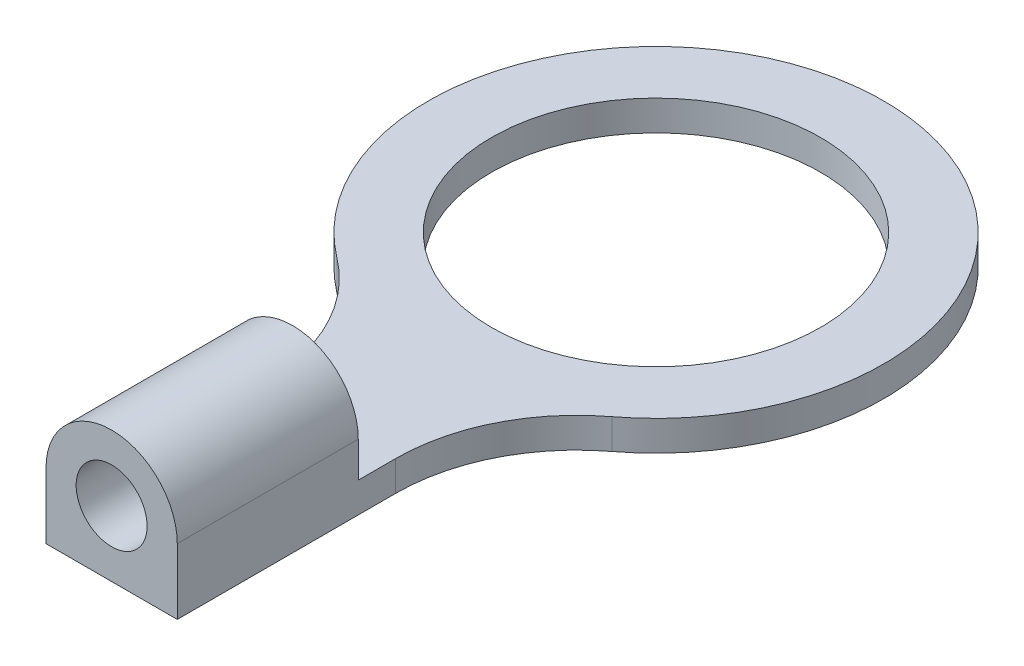
ISO-10303-21;
HEADER;
FILE_DESCRIPTION(('STEP AP214'),'2;1');
FILE_NAME('part.step','',(''),(''),'','','');
FILE_SCHEMA(('AUTOMOTIVE_DESIGN { 1 0 10303 214 1 1 1 1 }'));
ENDSEC;
DATA;
#1=APPLICATION_CONTEXT('core data for automotive mechanical design processes');
#2=APPLICATION_PROTOCOL_DEFINITION('international standard','automotive_design',2000,#1);
#3=PRODUCT_CONTEXT('',#1,'mechanical');
#4=PRODUCT('Part','Part','',(#3));
#5=PRODUCT_RELATED_PRODUCT_CATEGORY('part','',(#4));
#6=PRODUCT_DEFINITION_FORMATION('','',#4);
#7=PRODUCT_DEFINITION_CONTEXT('part definition',#1,'design');
#8=PRODUCT_DEFINITION('design','',#6,#7);
#9=PRODUCT_DEFINITION_SHAPE('','',#8);
#10=(LENGTH_UNIT() NAMED_UNIT(*) SI_UNIT(.MILLI.,.METRE.));
#11=(NAMED_UNIT(*) PLANE_ANGLE_UNIT() SI_UNIT($,.RADIAN.));
#12=(NAMED_UNIT(*) SI_UNIT($,.STERADIAN.) SOLID_ANGLE_UNIT());
#13=UNCERTAINTY_MEASURE_WITH_UNIT(LENGTH_MEASURE(1.E-05),#10,'distance_accuracy_value','');
#14=(GEOMETRIC_REPRESENTATION_CONTEXT(3) GLOBAL_UNCERTAINTY_ASSIGNED_CONTEXT((#13)) GLOBAL_UNIT_ASSIGNED_CONTEXT((#10,
#11,#12)) REPRESENTATION_CONTEXT('',''));
#15=CARTESIAN_POINT('',(0.,0.,0.));
#16=DIRECTION('',(0.,0.,1.));
#17=DIRECTION('',(1.,0.,0.));
#18=AXIS2_PLACEMENT_3D('',#15,#16,#17);
#19=CARTESIAN_POINT('',(6.4897,0.79375,8.5787348437867));
#20=DIRECTION('',(0.,-1.,0.));
#21=DIRECTION('',(0.,0.,-1.));
#22=AXIS2_PLACEMENT_3D('',#19,#20,#21);
#23=PLANE('',#22);
#24=CARTESIAN_POINT('',(0.,0.79375,0.));
#25=DIRECTION('',(0.,1.,0.));
#26=DIRECTION('',(0.,0.,1.));
#27=AXIS2_PLACEMENT_3D('',#24,#25,#26);
#28=CIRCLE('',#27,4.3307);
#29=CARTESIAN_POINT('',(0.,0.79375,4.3307));
#30=VERTEX_POINT('',#29);
#31=EDGE_CURVE('E133',#30,#30,#28,.T.);
#32=ORIENTED_EDGE('',*,*,#31,.F.);
#33=EDGE_LOOP('',(#32));
#34=FACE_BOUND('',#33,.T.);
#35=DIRECTION('',(-1.,0.,0.));
#36=VECTOR('',#35,1.);
#37=CARTESIAN_POINT('',(6.4897,0.79375,9.5631));
#38=LINE('',#37,#36);
#39=CARTESIAN_POINT('',(1.7272,0.79375,9.5631));
#40=VERTEX_POINT('',#39);
#41=CARTESIAN_POINT('',(0.,0.793750000000001,9.5631));
#42=VERTEX_POINT('',#41);
#43=EDGE_CURVE('E51',#40,#42,#38,.T.);
#44=ORIENTED_EDGE('',*,*,#43,.F.);
#45=DIRECTION('',(0.,0.,-1.));
#46=VECTOR('',#45,1.);
#47=CARTESIAN_POINT('',(1.7272,0.79375,14.3256));
#48=LINE('',#47,#46);
#49=CARTESIAN_POINT('',(1.7272,0.79375,8.5787348437867));
#50=VERTEX_POINT('',#49);
#51=EDGE_CURVE('E140',#40,#50,#48,.T.);
#52=ORIENTED_EDGE('',*,*,#51,.T.);
#53=CARTESIAN_POINT('',(6.4897,0.79375,8.5787348437867));
#54=DIRECTION('',(0.,-1.,0.));
#55=DIRECTION('',(0.,0.,-1.));
#56=AXIS2_PLACEMENT_3D('',#53,#54,#55);
#57=CIRCLE('',#56,4.7625);
#58=CARTESIAN_POINT('',(3.61645619834711,0.79375,4.7805936791822));
#59=VERTEX_POINT('',#58);
#60=EDGE_CURVE('E142',#50,#59,#57,.T.);
#61=ORIENTED_EDGE('',*,*,#60,.T.);
#62=CARTESIAN_POINT('',(0.,0.79375,0.));
#63=DIRECTION('',(0.,1.,0.));
#64=DIRECTION('',(0.,0.,1.));
#65=AXIS2_PLACEMENT_3D('',#62,#63,#64);
#66=CIRCLE('',#65,5.9944);
#67=CARTESIAN_POINT('',(-3.61645619834711,0.79375,4.7805936791822));
#68=VERTEX_POINT('',#67);
#69=EDGE_CURVE('E145',#59,#68,#66,.T.);
#70=ORIENTED_EDGE('',*,*,#69,.T.);
#71=CARTESIAN_POINT('',(-6.4897,0.79375,8.5787348437867));
#72=DIRECTION('',(0.,-1.,0.));
#73=DIRECTION('',(0.,0.,1.));
#74=AXIS2_PLACEMENT_3D('',#71,#72,#73);
#75=CIRCLE('',#74,4.7625);
#76=CARTESIAN_POINT('',(-1.7272,0.79375,8.5787348437867));
#77=VERTEX_POINT('',#76);
#78=EDGE_CURVE('E147',#68,#77,#75,.T.);
#79=ORIENTED_EDGE('',*,*,#78,.T.);
#80=DIRECTION('',(0.,0.,1.));
#81=VECTOR('',#80,1.);
#82=CARTESIAN_POINT('',(-1.7272,0.79375,14.3256));
#83=LINE('',#82,#81);
#84=CARTESIAN_POINT('',(-1.7272,0.79375,9.5631));
#85=VERTEX_POINT('',#84);
#86=EDGE_CURVE('E149',#77,#85,#83,.T.);
#87=ORIENTED_EDGE('',*,*,#86,.T.);
#88=EDGE_CURVE('E47',#42,#85,#38,.T.);
#89=ORIENTED_EDGE('',*,*,#88,.F.);
#90=EDGE_LOOP('',(#44,#52,#61,#70,#79,#87,#89));
#91=FACE_BOUND('',#90,.T.);
#92=ADVANCED_FACE('F32',(#34,#91),#23,.F.);
#93=CARTESIAN_POINT('',(6.4897,0.,8.5787348437867));
#94=DIRECTION('',(0.,-1.,0.));
#95=DIRECTION('',(0.,0.,-1.));
#96=AXIS2_PLACEMENT_3D('',#93,#94,#95);
#97=PLANE('',#96);
#98=DIRECTION('',(1.,0.,0.));
#99=VECTOR('',#98,1.);
#100=CARTESIAN_POINT('',(-1.7272,0.,14.3256));
#101=LINE('',#100,#99);
#102=CARTESIAN_POINT('',(-1.7272,0.,14.3256));
#103=VERTEX_POINT('',#102);
#104=CARTESIAN_POINT('',(1.7272,0.,14.3256));
#105=VERTEX_POINT('',#104);
#106=EDGE_CURVE('E143',#103,#105,#101,.T.);
#107=ORIENTED_EDGE('',*,*,#106,.F.);
#108=DIRECTION('',(0.,0.,1.));
#109=VECTOR('',#108,1.);
#110=CARTESIAN_POINT('',(-1.7272,0.,14.3256));
#111=LINE('',#110,#109);
#112=CARTESIAN_POINT('',(-1.7272,0.,8.5787348437867));
#113=VERTEX_POINT('',#112);
#114=EDGE_CURVE('E159',#113,#103,#111,.T.);
#115=ORIENTED_EDGE('',*,*,#114,.F.);
#116=CARTESIAN_POINT('',(-6.4897,0.,8.5787348437867));
#117=DIRECTION('',(0.,-1.,0.));
#118=DIRECTION('',(0.,0.,1.));
#119=AXIS2_PLACEMENT_3D('',#116,#117,#118);
#120=CIRCLE('',#119,4.7625);
#121=CARTESIAN_POINT('',(-3.61645619834711,0.,4.7805936791822));
#122=VERTEX_POINT('',#121);
#123=EDGE_CURVE('E157',#122,#113,#120,.T.);
#124=ORIENTED_EDGE('',*,*,#123,.F.);
#125=CARTESIAN_POINT('',(0.,0.,0.));
#126=DIRECTION('',(0.,1.,0.));
#127=DIRECTION('',(0.,0.,1.));
#128=AXIS2_PLACEMENT_3D('',#125,#126,#127);
#129=CIRCLE('',#128,5.9944);
#130=CARTESIAN_POINT('',(3.61645619834711,0.,4.7805936791822));
#131=VERTEX_POINT('',#130);
#132=EDGE_CURVE('E155',#131,#122,#129,.T.);
#133=ORIENTED_EDGE('',*,*,#132,.F.);
#134=CARTESIAN_POINT('',(6.4897,0.,8.5787348437867));
#135=DIRECTION('',(0.,-1.,0.));
#136=DIRECTION('',(0.,0.,-1.));
#137=AXIS2_PLACEMENT_3D('',#134,#135,#136);
#138=CIRCLE('',#137,4.7625);
#139=CARTESIAN_POINT('',(1.7272,0.,8.5787348437867));
#140=VERTEX_POINT('',#139);
#141=EDGE_CURVE('E153',#140,#131,#138,.T.);
#142=ORIENTED_EDGE('',*,*,#141,.F.);
#143=DIRECTION('',(0.,0.,-1.));
#144=VECTOR('',#143,1.);
#145=CARTESIAN_POINT('',(1.7272,0.,14.3256));
#146=LINE('',#145,#144);
#147=EDGE_CURVE('E136',#105,#140,#146,.T.);
#148=ORIENTED_EDGE('',*,*,#147,.F.);
#149=EDGE_LOOP('',(#107,#115,#124,#133,#142,#148));
#150=FACE_BOUND('',#149,.T.);
#151=CARTESIAN_POINT('',(0.,0.,0.));
#152=DIRECTION('',(0.,1.,0.));
#153=DIRECTION('',(0.,0.,1.));
#154=AXIS2_PLACEMENT_3D('',#151,#152,#153);
#155=CIRCLE('',#154,4.3307);
#156=CARTESIAN_POINT('',(0.,0.,4.3307));
#157=VERTEX_POINT('',#156);
#158=EDGE_CURVE('E137',#157,#157,#155,.T.);
#159=ORIENTED_EDGE('',*,*,#158,.T.);
#160=EDGE_LOOP('',(#159));
#161=FACE_BOUND('',#160,.T.);
#162=ADVANCED_FACE('F183',(#150,#161),#97,.T.);
#163=CARTESIAN_POINT('',(1.7272,0.79375,14.3256));
#164=DIRECTION('',(-1.,0.,0.));
#165=DIRECTION('',(0.,0.,1.));
#166=AXIS2_PLACEMENT_3D('',#163,#164,#165);
#167=PLANE('',#166);
#168=ORIENTED_EDGE('',*,*,#147,.T.);
#169=DIRECTION('',(0.,-1.,0.));
#170=VECTOR('',#169,1.);
#171=CARTESIAN_POINT('',(1.7272,0.79375,8.5787348437867));
#172=LINE('',#171,#170);
#173=EDGE_CURVE('E11',#50,#140,#172,.T.);
#174=ORIENTED_EDGE('',*,*,#173,.F.);
#175=ORIENTED_EDGE('',*,*,#51,.F.);
#176=DIRECTION('',(0.,1.,0.));
#177=VECTOR('',#176,1.);
#178=CARTESIAN_POINT('',(1.7272,1.7272,9.5631));
#179=LINE('',#178,#177);
#180=CARTESIAN_POINT('',(1.7272,1.7272,9.5631));
#181=VERTEX_POINT('',#180);
#182=EDGE_CURVE('E110',#40,#181,#179,.T.);
#183=ORIENTED_EDGE('',*,*,#182,.T.);
#184=DIRECTION('',(0.,0.,1.));
#185=VECTOR('',#184,1.);
#186=CARTESIAN_POINT('',(1.7272,1.7272,9.5631));
#187=LINE('',#186,#185);
#188=CARTESIAN_POINT('',(1.7272,1.7272,14.3256));
#189=VERTEX_POINT('',#188);
#190=EDGE_CURVE('E109',#181,#189,#187,.T.);
#191=ORIENTED_EDGE('',*,*,#190,.T.);
#192=DIRECTION('',(0.,-1.,0.));
#193=VECTOR('',#192,1.);
#194=CARTESIAN_POINT('',(1.7272,0.79375,14.3256));
#195=LINE('',#194,#193);
#196=EDGE_CURVE('E151',#189,#105,#195,.T.);
#197=ORIENTED_EDGE('',*,*,#196,.T.);
#198=EDGE_LOOP('',(#168,#174,#175,#183,#191,#197));
#199=FACE_BOUND('',#198,.T.);
#200=ADVANCED_FACE('F34',(#199),#167,.F.);
#201=CARTESIAN_POINT('',(6.4897,0.79375,8.5787348437867));
#202=DIRECTION('',(0.,-1.,0.));
#203=DIRECTION('',(0.,0.,-1.));
#204=AXIS2_PLACEMENT_3D('',#201,#202,#203);
#205=CYLINDRICAL_SURFACE('',#204,4.7625);
#206=ORIENTED_EDGE('',*,*,#141,.T.);
#207=DIRECTION('',(0.,-1.,0.));
#208=VECTOR('',#207,1.);
#209=CARTESIAN_POINT('',(3.61645619834711,0.79375,4.7805936791822));
#210=LINE('',#209,#208);
#211=EDGE_CURVE('E40',#59,#131,#210,.T.);
#212=ORIENTED_EDGE('',*,*,#211,.F.);
#213=ORIENTED_EDGE('',*,*,#60,.F.);
#214=ORIENTED_EDGE('',*,*,#173,.T.);
#215=EDGE_LOOP('',(#206,#212,#213,#214));
#216=FACE_BOUND('',#215,.T.);
#217=ADVANCED_FACE('F192',(#216),#205,.F.);
#218=CARTESIAN_POINT('',(0.,0.79375,0.));
#219=DIRECTION('',(0.,-1.,0.));
#220=DIRECTION('',(0.,0.,-1.));
#221=AXIS2_PLACEMENT_3D('',#218,#219,#220);
#222=CYLINDRICAL_SURFACE('',#221,5.9944);
#223=ORIENTED_EDGE('',*,*,#132,.T.);
#224=DIRECTION('',(0.,-1.,0.));
#225=VECTOR('',#224,1.);
#226=CARTESIAN_POINT('',(-3.61645619834711,0.79375,4.7805936791822));
#227=LINE('',#226,#225);
#228=EDGE_CURVE('E168',#68,#122,#227,.T.);
#229=ORIENTED_EDGE('',*,*,#228,.F.);
#230=ORIENTED_EDGE('',*,*,#69,.F.);
#231=ORIENTED_EDGE('',*,*,#211,.T.);
#232=EDGE_LOOP('',(#223,#229,#230,#231));
#233=FACE_BOUND('',#232,.T.);
#234=ADVANCED_FACE('F175',(#233),#222,.T.);
#235=CARTESIAN_POINT('',(-6.4897,0.79375,8.5787348437867));
#236=DIRECTION('',(0.,-1.,0.));
#237=DIRECTION('',(0.,0.,-1.));
#238=AXIS2_PLACEMENT_3D('',#235,#236,#237);
#239=CYLINDRICAL_SURFACE('',#238,4.7625);
#240=ORIENTED_EDGE('',*,*,#123,.T.);
#241=DIRECTION('',(0.,-1.,0.));
#242=VECTOR('',#241,1.);
#243=CARTESIAN_POINT('',(-1.7272,0.79375,8.5787348437867));
#244=LINE('',#243,#242);
#245=EDGE_CURVE('E165',#77,#113,#244,.T.);
#246=ORIENTED_EDGE('',*,*,#245,.F.);
#247=ORIENTED_EDGE('',*,*,#78,.F.);
#248=ORIENTED_EDGE('',*,*,#228,.T.);
#249=EDGE_LOOP('',(#240,#246,#247,#248));
#250=FACE_BOUND('',#249,.T.);
#251=ADVANCED_FACE('F189',(#250),#239,.F.);
#252=CARTESIAN_POINT('',(-1.7272,0.79375,14.3256));
#253=DIRECTION('',(1.,0.,0.));
#254=DIRECTION('',(0.,0.,-1.));
#255=AXIS2_PLACEMENT_3D('',#252,#253,#254);
#256=PLANE('',#255);
#257=DIRECTION('',(0.,-1.,0.));
#258=VECTOR('',#257,1.);
#259=CARTESIAN_POINT('',(-1.7272,0.79375,14.3256));
#260=LINE('',#259,#258);
#261=CARTESIAN_POINT('',(-1.7272,1.7272,14.3256));
#262=VERTEX_POINT('',#261);
#263=EDGE_CURVE('E104',#262,#103,#260,.T.);
#264=ORIENTED_EDGE('',*,*,#263,.F.);
#265=DIRECTION('',(0.,0.,1.));
#266=VECTOR('',#265,1.);
#267=CARTESIAN_POINT('',(-1.7272,1.7272,9.5631));
#268=LINE('',#267,#266);
#269=CARTESIAN_POINT('',(-1.7272,1.7272,9.5631));
#270=VERTEX_POINT('',#269);
#271=EDGE_CURVE('E98',#270,#262,#268,.T.);
#272=ORIENTED_EDGE('',*,*,#271,.F.);
#273=DIRECTION('',(0.,-1.,0.));
#274=VECTOR('',#273,1.);
#275=CARTESIAN_POINT('',(-1.7272,0.,9.5631));
#276=LINE('',#275,#274);
#277=EDGE_CURVE('E102',#270,#85,#276,.T.);
#278=ORIENTED_EDGE('',*,*,#277,.T.);
#279=ORIENTED_EDGE('',*,*,#86,.F.);
#280=ORIENTED_EDGE('',*,*,#245,.T.);
#281=ORIENTED_EDGE('',*,*,#114,.T.);
#282=EDGE_LOOP('',(#264,#272,#278,#279,#280,#281));
#283=FACE_BOUND('',#282,.T.);
#284=ADVANCED_FACE('F100',(#283),#256,.F.);
#285=CARTESIAN_POINT('',(-1.7272,0.79375,14.3256));
#286=DIRECTION('',(0.,0.,-1.));
#287=DIRECTION('',(-1.,0.,0.));
#288=AXIS2_PLACEMENT_3D('',#285,#286,#287);
#289=PLANE('',#288);
#290=ORIENTED_EDGE('',*,*,#196,.F.);
#291=CARTESIAN_POINT('',(0.,1.7272,14.3256));
#292=DIRECTION('',(0.,0.,1.));
#293=DIRECTION('',(1.,0.,0.));
#294=AXIS2_PLACEMENT_3D('',#291,#292,#293);
#295=CIRCLE('',#294,1.7272);
#296=EDGE_CURVE('E122',#189,#262,#295,.T.);
#297=ORIENTED_EDGE('',*,*,#296,.T.);
#298=ORIENTED_EDGE('',*,*,#263,.T.);
#299=ORIENTED_EDGE('',*,*,#106,.T.);
#300=EDGE_LOOP('',(#290,#297,#298,#299));
#301=FACE_BOUND('',#300,.T.);
#302=CARTESIAN_POINT('',(0.,1.7272,14.3256));
#303=DIRECTION('',(0.,0.,1.));
#304=DIRECTION('',(1.,0.,0.));
#305=AXIS2_PLACEMENT_3D('',#302,#303,#304);
#306=CIRCLE('',#305,0.933449999999997);
#307=CARTESIAN_POINT('',(0.93345,1.7272,14.3256));
#308=VERTEX_POINT('',#307);
#309=EDGE_CURVE('E127',#308,#308,#306,.T.);
#310=ORIENTED_EDGE('',*,*,#309,.F.);
#311=EDGE_LOOP('',(#310));
#312=FACE_BOUND('',#311,.T.);
#313=ADVANCED_FACE('F195',(#301,#312),#289,.F.);
#314=CARTESIAN_POINT('',(0.,0.79375,0.));
#315=DIRECTION('',(0.,-1.,0.));
#316=DIRECTION('',(0.,0.,-1.));
#317=AXIS2_PLACEMENT_3D('',#314,#315,#316);
#318=CYLINDRICAL_SURFACE('',#317,4.3307);
#319=ORIENTED_EDGE('',*,*,#31,.T.);
#320=EDGE_LOOP('',(#319));
#321=FACE_BOUND('',#320,.T.);
#322=ORIENTED_EDGE('',*,*,#158,.F.);
#323=EDGE_LOOP('',(#322));
#324=FACE_BOUND('',#323,.T.);
#325=ADVANCED_FACE('F204',(#321,#324),#318,.F.);
#326=CARTESIAN_POINT('',(0.,1.7272,9.5631));
#327=DIRECTION('',(0.,0.,1.));
#328=DIRECTION('',(1.,0.,0.));
#329=AXIS2_PLACEMENT_3D('',#326,#327,#328);
#330=PLANE('',#329);
#331=ORIENTED_EDGE('',*,*,#182,.F.);
#332=ORIENTED_EDGE('',*,*,#43,.T.);
#333=CARTESIAN_POINT('',(0.,1.7272,9.5631));
#334=DIRECTION('',(0.,0.,1.));
#335=DIRECTION('',(1.,0.,0.));
#336=AXIS2_PLACEMENT_3D('',#333,#334,#335);
#337=CIRCLE('',#336,0.933449999999997);
#338=EDGE_CURVE('E124',#42,#42,#337,.T.);
#339=ORIENTED_EDGE('',*,*,#338,.T.);
#340=ORIENTED_EDGE('',*,*,#88,.T.);
#341=ORIENTED_EDGE('',*,*,#277,.F.);
#342=CARTESIAN_POINT('',(0.,1.7272,9.5631));
#343=DIRECTION('',(0.,0.,1.));
#344=DIRECTION('',(1.,0.,0.));
#345=AXIS2_PLACEMENT_3D('',#342,#343,#344);
#346=CIRCLE('',#345,1.7272);
#347=EDGE_CURVE('E116',#181,#270,#346,.T.);
#348=ORIENTED_EDGE('',*,*,#347,.F.);
#349=EDGE_LOOP('',(#331,#332,#339,#340,#341,#348));
#350=FACE_BOUND('',#349,.T.);
#351=ADVANCED_FACE('F115',(#350),#330,.F.);
#352=CARTESIAN_POINT('',(0.,1.7272,9.5631));
#353=DIRECTION('',(0.,0.,1.));
#354=DIRECTION('',(1.,0.,0.));
#355=AXIS2_PLACEMENT_3D('',#352,#353,#354);
#356=CYLINDRICAL_SURFACE('',#355,1.7272);
#357=ORIENTED_EDGE('',*,*,#296,.F.);
#358=ORIENTED_EDGE('',*,*,#190,.F.);
#359=ORIENTED_EDGE('',*,*,#347,.T.);
#360=ORIENTED_EDGE('',*,*,#271,.T.);
#361=EDGE_LOOP('',(#357,#358,#359,#360));
#362=FACE_BOUND('',#361,.T.);
#363=ADVANCED_FACE('F120',(#362),#356,.T.);
#364=CARTESIAN_POINT('',(0.,1.7272,9.5631));
#365=DIRECTION('',(0.,0.,1.));
#366=DIRECTION('',(1.,0.,0.));
#367=AXIS2_PLACEMENT_3D('',#364,#365,#366);
#368=CYLINDRICAL_SURFACE('',#367,0.933449999999997);
#369=ORIENTED_EDGE('',*,*,#309,.T.);
#370=EDGE_LOOP('',(#369));
#371=FACE_BOUND('',#370,.T.);
#372=ORIENTED_EDGE('',*,*,#338,.F.);
#373=EDGE_LOOP('',(#372));
#374=FACE_BOUND('',#373,.T.);
#375=ADVANCED_FACE('F202',(#371,#374),#368,.F.);
#376=CLOSED_SHELL('',(#92,#162,#200,#217,#234,#251,#284,#313,#325,#351,#363,#375));
#377=MANIFOLD_SOLID_BREP('B2',#376);
#378=ADVANCED_BREP_SHAPE_REPRESENTATION('',(#18,#377),#14);
#379=SHAPE_DEFINITION_REPRESENTATION(#9,#378);
ENDSEC;
END-ISO-10303-21;
